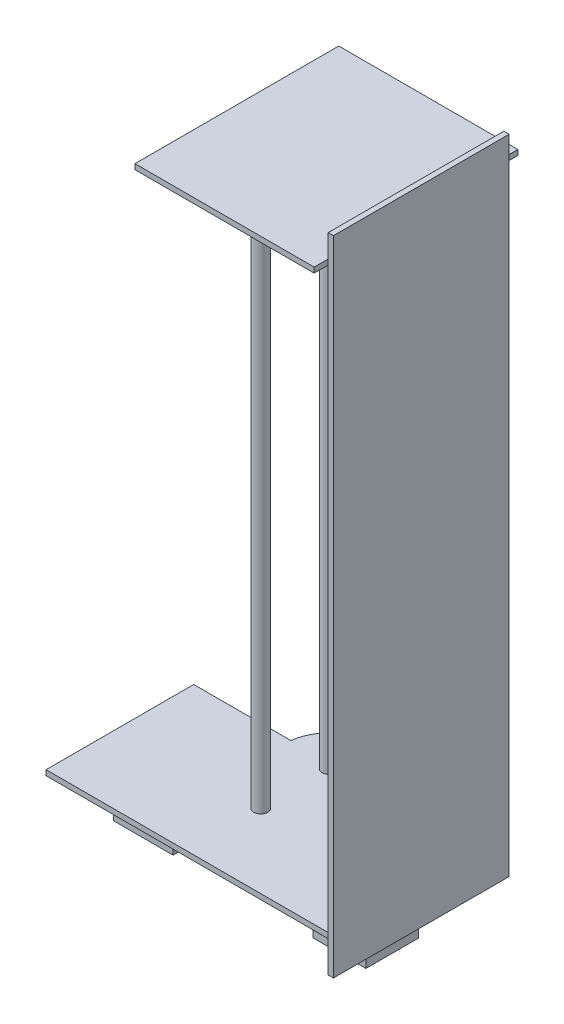
ISO-10303-21;
HEADER;
FILE_DESCRIPTION(('STEP AP214'),'2;1');
FILE_NAME('part.step','',(''),(''),'','','');
FILE_SCHEMA(('AUTOMOTIVE_DESIGN { 1 0 10303 214 1 1 1 1 }'));
ENDSEC;
DATA;
#1=APPLICATION_CONTEXT('core data for automotive mechanical design processes');
#2=APPLICATION_PROTOCOL_DEFINITION('international standard','automotive_design',2000,#1);
#3=PRODUCT_CONTEXT('',#1,'mechanical');
#4=PRODUCT('Part','Part','',(#3));
#5=PRODUCT_RELATED_PRODUCT_CATEGORY('part','',(#4));
#6=PRODUCT_DEFINITION_FORMATION('','',#4);
#7=PRODUCT_DEFINITION_CONTEXT('part definition',#1,'design');
#8=PRODUCT_DEFINITION('design','',#6,#7);
#9=PRODUCT_DEFINITION_SHAPE('','',#8);
#10=(LENGTH_UNIT() NAMED_UNIT(*) SI_UNIT(.MILLI.,.METRE.));
#11=(NAMED_UNIT(*) PLANE_ANGLE_UNIT() SI_UNIT($,.RADIAN.));
#12=(NAMED_UNIT(*) SI_UNIT($,.STERADIAN.) SOLID_ANGLE_UNIT());
#13=UNCERTAINTY_MEASURE_WITH_UNIT(LENGTH_MEASURE(1.E-05),#10,'distance_accuracy_value','');
#14=(GEOMETRIC_REPRESENTATION_CONTEXT(3) GLOBAL_UNCERTAINTY_ASSIGNED_CONTEXT((#13)) GLOBAL_UNIT_ASSIGNED_CONTEXT((#10,
#11,#12)) REPRESENTATION_CONTEXT('',''));
#15=CARTESIAN_POINT('',(0.,0.,0.));
#16=DIRECTION('',(0.,0.,1.));
#17=DIRECTION('',(1.,0.,0.));
#18=AXIS2_PLACEMENT_3D('',#15,#16,#17);
#19=CARTESIAN_POINT('',(168.5,0.,0.));
#20=DIRECTION('',(-1.,0.,0.));
#21=DIRECTION('',(0.,0.,1.));
#22=AXIS2_PLACEMENT_3D('',#19,#20,#21);
#23=PLANE('',#22);
#24=DIRECTION('',(0.,-1.,0.));
#25=VECTOR('',#24,1.);
#26=CARTESIAN_POINT('',(168.5,3.,0.));
#27=LINE('',#26,#25);
#28=CARTESIAN_POINT('',(168.5,3.,0.));
#29=VERTEX_POINT('',#28);
#30=CARTESIAN_POINT('',(168.5,0.,0.));
#31=VERTEX_POINT('',#30);
#32=EDGE_CURVE('E392',#29,#31,#27,.T.);
#33=ORIENTED_EDGE('',*,*,#32,.T.);
#34=DIRECTION('',(0.,0.,-1.));
#35=VECTOR('',#34,1.);
#36=CARTESIAN_POINT('',(168.5,0.,0.));
#37=LINE('',#36,#35);
#38=CARTESIAN_POINT('',(168.5,0.,-84.1790679657501));
#39=VERTEX_POINT('',#38);
#40=EDGE_CURVE('E361',#31,#39,#37,.T.);
#41=ORIENTED_EDGE('',*,*,#40,.T.);
#42=DIRECTION('',(0.,-1.,0.));
#43=VECTOR('',#42,1.);
#44=CARTESIAN_POINT('',(168.5,3.,-84.1790679657501));
#45=LINE('',#44,#43);
#46=CARTESIAN_POINT('',(168.5,3.,-84.1790679657501));
#47=VERTEX_POINT('',#46);
#48=EDGE_CURVE('E377',#47,#39,#45,.T.);
#49=ORIENTED_EDGE('',*,*,#48,.F.);
#50=DIRECTION('',(0.,0.,-1.));
#51=VECTOR('',#50,1.);
#52=CARTESIAN_POINT('',(168.5,3.,0.));
#53=LINE('',#52,#51);
#54=EDGE_CURVE('E375',#29,#47,#53,.T.);
#55=ORIENTED_EDGE('',*,*,#54,.F.);
#56=EDGE_LOOP('',(#33,#41,#49,#55));
#57=FACE_BOUND('',#56,.T.);
#58=DIRECTION('',(0.,-1.,0.));
#59=VECTOR('',#58,1.);
#60=CARTESIAN_POINT('',(168.5,-10.,7.91046601712495));
#61=LINE('',#60,#59);
#62=CARTESIAN_POINT('',(168.5,340.,7.91046601712495));
#63=VERTEX_POINT('',#62);
#64=CARTESIAN_POINT('',(168.5,-10.,7.91046601712495));
#65=VERTEX_POINT('',#64);
#66=EDGE_CURVE('E239',#63,#65,#61,.T.);
#67=ORIENTED_EDGE('',*,*,#66,.F.);
#68=DIRECTION('',(0.,0.,-1.));
#69=VECTOR('',#68,1.);
#70=CARTESIAN_POINT('',(168.5,340.,0.));
#71=LINE('',#70,#69);
#72=CARTESIAN_POINT('',(168.5,340.,-92.0895339828751));
#73=VERTEX_POINT('',#72);
#74=EDGE_CURVE('E46',#63,#73,#71,.T.);
#75=ORIENTED_EDGE('',*,*,#74,.T.);
#76=DIRECTION('',(0.,1.,0.));
#77=VECTOR('',#76,1.);
#78=CARTESIAN_POINT('',(168.5,-10.,-92.0895339828751));
#79=LINE('',#78,#77);
#80=CARTESIAN_POINT('',(168.5,-10.,-92.0895339828751));
#81=VERTEX_POINT('',#80);
#82=EDGE_CURVE('E262',#81,#73,#79,.T.);
#83=ORIENTED_EDGE('',*,*,#82,.F.);
#84=DIRECTION('',(0.,0.,-1.));
#85=VECTOR('',#84,1.);
#86=CARTESIAN_POINT('',(168.5,-10.,7.91046601712495));
#87=LINE('',#86,#85);
#88=EDGE_CURVE('E258',#65,#81,#87,.T.);
#89=ORIENTED_EDGE('',*,*,#88,.F.);
#90=EDGE_LOOP('',(#67,#75,#83,#89));
#91=FACE_BOUND('',#90,.T.);
#92=ADVANCED_FACE('F38',(#57,#91),#23,.T.);
#93=CARTESIAN_POINT('',(0.,0.,0.));
#94=DIRECTION('',(0.,1.,0.));
#95=DIRECTION('',(0.,0.,1.));
#96=AXIS2_PLACEMENT_3D('',#93,#94,#95);
#97=PLANE('',#96);
#98=DIRECTION('',(-1.,0.,0.));
#99=VECTOR('',#98,1.);
#100=CARTESIAN_POINT('',(11.2755253757975,0.,-57.));
#101=LINE('',#100,#99);
#102=CARTESIAN_POINT('',(45.2755253757975,0.,-57.));
#103=VERTEX_POINT('',#102);
#104=CARTESIAN_POINT('',(11.2755253757975,0.,-57.));
#105=VERTEX_POINT('',#104);
#106=EDGE_CURVE('E328',#103,#105,#101,.T.);
#107=ORIENTED_EDGE('',*,*,#106,.T.);
#108=DIRECTION('',(0.,0.,1.));
#109=VECTOR('',#108,1.);
#110=CARTESIAN_POINT('',(11.2755253757975,0.,-57.));
#111=LINE('',#110,#109);
#112=CARTESIAN_POINT('',(11.2755253757975,0.,-27.));
#113=VERTEX_POINT('',#112);
#114=EDGE_CURVE('E341',#105,#113,#111,.T.);
#115=ORIENTED_EDGE('',*,*,#114,.T.);
#116=DIRECTION('',(-1.,0.,0.));
#117=VECTOR('',#116,1.);
#118=CARTESIAN_POINT('',(11.2755253757975,0.,-27.));
#119=LINE('',#118,#117);
#120=CARTESIAN_POINT('',(45.2755253757975,0.,-27.));
#121=VERTEX_POINT('',#120);
#122=EDGE_CURVE('E323',#121,#113,#119,.T.);
#123=ORIENTED_EDGE('',*,*,#122,.F.);
#124=DIRECTION('',(0.,0.,1.));
#125=VECTOR('',#124,1.);
#126=CARTESIAN_POINT('',(45.2755253757975,0.,-57.));
#127=LINE('',#126,#125);
#128=EDGE_CURVE('E345',#103,#121,#127,.T.);
#129=ORIENTED_EDGE('',*,*,#128,.F.);
#130=EDGE_LOOP('',(#107,#115,#123,#129));
#131=FACE_BOUND('',#130,.T.);
#132=DIRECTION('',(0.999999435315813,0.,-0.00106271729752677));
#133=VECTOR('',#132,1.);
#134=CARTESIAN_POINT('',(-0.0892682025838781,0.,-83.9999051330834));
#135=LINE('',#134,#133);
#136=CARTESIAN_POINT('',(104.941145124996,0.,-84.1115228331218));
#137=VERTEX_POINT('',#136);
#138=EDGE_CURVE('E356',#137,#39,#135,.T.);
#139=ORIENTED_EDGE('',*,*,#138,.T.);
#140=ORIENTED_EDGE('',*,*,#40,.F.);
#141=DIRECTION('',(1.,0.,0.));
#142=VECTOR('',#141,1.);
#143=CARTESIAN_POINT('',(0.,0.,0.));
#144=LINE('',#143,#142);
#145=CARTESIAN_POINT('',(0.,0.,0.));
#146=VERTEX_POINT('',#145);
#147=EDGE_CURVE('E387',#146,#31,#144,.T.);
#148=ORIENTED_EDGE('',*,*,#147,.F.);
#149=DIRECTION('',(0.,0.,-1.));
#150=VECTOR('',#149,1.);
#151=CARTESIAN_POINT('',(0.,0.,0.));
#152=LINE('',#151,#150);
#153=CARTESIAN_POINT('',(0.,0.,-84.));
#154=VERTEX_POINT('',#153);
#155=EDGE_CURVE('E384',#146,#154,#152,.T.);
#156=ORIENTED_EDGE('',*,*,#155,.T.);
#157=CARTESIAN_POINT('',(55.3024785712186,0.,-84.0587709337608));
#158=VERTEX_POINT('',#157);
#159=EDGE_CURVE('E381',#154,#158,#135,.T.);
#160=ORIENTED_EDGE('',*,*,#159,.T.);
#161=CARTESIAN_POINT('',(80.125,0.,-81.0851485774938));
#162=DIRECTION('',(0.,1.,0.));
#163=DIRECTION('',(0.,0.,1.));
#164=AXIS2_PLACEMENT_3D('',#161,#162,#163);
#165=CIRCLE('',#164,25.);
#166=EDGE_CURVE('E380',#137,#158,#165,.T.);
#167=ORIENTED_EDGE('',*,*,#166,.F.);
#168=EDGE_LOOP('',(#139,#140,#148,#156,#160,#167));
#169=FACE_BOUND('',#168,.T.);
#170=DIRECTION('',(-1.,0.,0.));
#171=VECTOR('',#170,1.);
#172=CARTESIAN_POINT('',(125.075525375797,0.,-57.));
#173=LINE('',#172,#171);
#174=CARTESIAN_POINT('',(155.075525375797,0.,-57.));
#175=VERTEX_POINT('',#174);
#176=CARTESIAN_POINT('',(125.075525375797,0.,-57.));
#177=VERTEX_POINT('',#176);
#178=EDGE_CURVE('E294',#175,#177,#173,.T.);
#179=ORIENTED_EDGE('',*,*,#178,.T.);
#180=DIRECTION('',(0.,0.,1.));
#181=VECTOR('',#180,1.);
#182=CARTESIAN_POINT('',(125.075525375797,0.,-57.));
#183=LINE('',#182,#181);
#184=CARTESIAN_POINT('',(125.075525375797,0.,-27.));
#185=VERTEX_POINT('',#184);
#186=EDGE_CURVE('E304',#177,#185,#183,.T.);
#187=ORIENTED_EDGE('',*,*,#186,.T.);
#188=DIRECTION('',(-1.,0.,0.));
#189=VECTOR('',#188,1.);
#190=CARTESIAN_POINT('',(125.075525375797,0.,-27.));
#191=LINE('',#190,#189);
#192=CARTESIAN_POINT('',(155.075525375797,0.,-27.));
#193=VERTEX_POINT('',#192);
#194=EDGE_CURVE('E289',#193,#185,#191,.T.);
#195=ORIENTED_EDGE('',*,*,#194,.F.);
#196=DIRECTION('',(0.,0.,1.));
#197=VECTOR('',#196,1.);
#198=CARTESIAN_POINT('',(155.075525375797,0.,-57.));
#199=LINE('',#198,#197);
#200=EDGE_CURVE('E308',#175,#193,#199,.T.);
#201=ORIENTED_EDGE('',*,*,#200,.F.);
#202=EDGE_LOOP('',(#179,#187,#195,#201));
#203=FACE_BOUND('',#202,.T.);
#204=ADVANCED_FACE('F446',(#131,#169,#203),#97,.F.);
#205=CARTESIAN_POINT('',(-0.0892682025838781,3.,-83.9999051330834));
#206=DIRECTION('',(-0.00106271729752677,0.,-0.999999435315813));
#207=DIRECTION('',(-0.999999435315813,0.,0.00106271729752677));
#208=AXIS2_PLACEMENT_3D('',#205,#206,#207);
#209=PLANE('',#208);
#210=ORIENTED_EDGE('',*,*,#138,.F.);
#211=DIRECTION('',(0.,-1.,0.));
#212=VECTOR('',#211,1.);
#213=CARTESIAN_POINT('',(104.941145124996,3.,-84.1115228331218));
#214=LINE('',#213,#212);
#215=CARTESIAN_POINT('',(104.941145124996,3.,-84.1115228331218));
#216=VERTEX_POINT('',#215);
#217=EDGE_CURVE('E401',#216,#137,#214,.T.);
#218=ORIENTED_EDGE('',*,*,#217,.F.);
#219=DIRECTION('',(0.999999435315813,0.,-0.00106271729752677));
#220=VECTOR('',#219,1.);
#221=CARTESIAN_POINT('',(-0.0892682025838781,3.,-83.9999051330834));
#222=LINE('',#221,#220);
#223=EDGE_CURVE('E364',#216,#47,#222,.T.);
#224=ORIENTED_EDGE('',*,*,#223,.T.);
#225=ORIENTED_EDGE('',*,*,#48,.T.);
#226=EDGE_LOOP('',(#210,#218,#224,#225));
#227=FACE_BOUND('',#226,.T.);
#228=ADVANCED_FACE('F451',(#227),#209,.T.);
#229=CARTESIAN_POINT('',(80.125,3.,-81.0851485774938));
#230=DIRECTION('',(0.,-1.,0.));
#231=DIRECTION('',(0.,0.,-1.));
#232=AXIS2_PLACEMENT_3D('',#229,#230,#231);
#233=CYLINDRICAL_SURFACE('',#232,25.);
#234=ORIENTED_EDGE('',*,*,#166,.T.);
#235=DIRECTION('',(0.,-1.,0.));
#236=VECTOR('',#235,1.);
#237=CARTESIAN_POINT('',(55.3024785712186,3.,-84.0587709337608));
#238=LINE('',#237,#236);
#239=CARTESIAN_POINT('',(55.3024785712186,3.,-84.0587709337608));
#240=VERTEX_POINT('',#239);
#241=EDGE_CURVE('E399',#240,#158,#238,.T.);
#242=ORIENTED_EDGE('',*,*,#241,.F.);
#243=CARTESIAN_POINT('',(80.125,3.,-81.0851485774938));
#244=DIRECTION('',(0.,1.,0.));
#245=DIRECTION('',(0.,0.,1.));
#246=AXIS2_PLACEMENT_3D('',#243,#244,#245);
#247=CIRCLE('',#246,25.);
#248=EDGE_CURVE('E367',#216,#240,#247,.T.);
#249=ORIENTED_EDGE('',*,*,#248,.F.);
#250=ORIENTED_EDGE('',*,*,#217,.T.);
#251=EDGE_LOOP('',(#234,#242,#249,#250));
#252=FACE_BOUND('',#251,.T.);
#253=ADVANCED_FACE('F40',(#252),#233,.T.);
#254=ORIENTED_EDGE('',*,*,#159,.F.);
#255=DIRECTION('',(0.,-1.,0.));
#256=VECTOR('',#255,1.);
#257=CARTESIAN_POINT('',(0.,3.,-84.));
#258=LINE('',#257,#256);
#259=CARTESIAN_POINT('',(0.,3.,-84.));
#260=VERTEX_POINT('',#259);
#261=EDGE_CURVE('E397',#260,#154,#258,.T.);
#262=ORIENTED_EDGE('',*,*,#261,.F.);
#263=EDGE_CURVE('E368',#260,#240,#222,.T.);
#264=ORIENTED_EDGE('',*,*,#263,.T.);
#265=ORIENTED_EDGE('',*,*,#241,.T.);
#266=EDGE_LOOP('',(#254,#262,#264,#265));
#267=FACE_BOUND('',#266,.T.);
#268=ADVANCED_FACE('F527',(#267),#209,.T.);
#269=CARTESIAN_POINT('',(0.,3.,0.));
#270=DIRECTION('',(-1.,0.,0.));
#271=DIRECTION('',(0.,0.,1.));
#272=AXIS2_PLACEMENT_3D('',#269,#270,#271);
#273=PLANE('',#272);
#274=ORIENTED_EDGE('',*,*,#155,.F.);
#275=DIRECTION('',(0.,-1.,0.));
#276=VECTOR('',#275,1.);
#277=CARTESIAN_POINT('',(0.,3.,0.));
#278=LINE('',#277,#276);
#279=CARTESIAN_POINT('',(0.,3.,0.));
#280=VERTEX_POINT('',#279);
#281=EDGE_CURVE('E395',#280,#146,#278,.T.);
#282=ORIENTED_EDGE('',*,*,#281,.F.);
#283=DIRECTION('',(0.,0.,-1.));
#284=VECTOR('',#283,1.);
#285=CARTESIAN_POINT('',(0.,3.,0.));
#286=LINE('',#285,#284);
#287=EDGE_CURVE('E370',#280,#260,#286,.T.);
#288=ORIENTED_EDGE('',*,*,#287,.T.);
#289=ORIENTED_EDGE('',*,*,#261,.T.);
#290=EDGE_LOOP('',(#274,#282,#288,#289));
#291=FACE_BOUND('',#290,.T.);
#292=ADVANCED_FACE('F524',(#291),#273,.T.);
#293=CARTESIAN_POINT('',(0.,3.,0.));
#294=DIRECTION('',(0.,0.,-1.));
#295=DIRECTION('',(-1.,0.,0.));
#296=AXIS2_PLACEMENT_3D('',#293,#294,#295);
#297=PLANE('',#296);
#298=ORIENTED_EDGE('',*,*,#147,.T.);
#299=ORIENTED_EDGE('',*,*,#32,.F.);
#300=DIRECTION('',(1.,0.,0.));
#301=VECTOR('',#300,1.);
#302=CARTESIAN_POINT('',(0.,3.,0.));
#303=LINE('',#302,#301);
#304=EDGE_CURVE('E373',#280,#29,#303,.T.);
#305=ORIENTED_EDGE('',*,*,#304,.F.);
#306=ORIENTED_EDGE('',*,*,#281,.T.);
#307=EDGE_LOOP('',(#298,#299,#305,#306));
#308=FACE_BOUND('',#307,.T.);
#309=ADVANCED_FACE('F519',(#308),#297,.F.);
#310=CARTESIAN_POINT('',(0.,3.,0.));
#311=DIRECTION('',(0.,1.,0.));
#312=DIRECTION('',(0.,0.,1.));
#313=AXIS2_PLACEMENT_3D('',#310,#311,#312);
#314=PLANE('',#313);
#315=CARTESIAN_POINT('',(80.125,3.,-81.0851485774938));
#316=DIRECTION('',(0.,1.,0.));
#317=DIRECTION('',(0.,0.,1.));
#318=AXIS2_PLACEMENT_3D('',#315,#316,#317);
#319=CIRCLE('',#318,4.00000000000001);
#320=CARTESIAN_POINT('',(80.125,3.,-77.0851485774938));
#321=VERTEX_POINT('',#320);
#322=EDGE_CURVE('E357',#321,#321,#319,.T.);
#323=ORIENTED_EDGE('',*,*,#322,.F.);
#324=EDGE_LOOP('',(#323));
#325=FACE_BOUND('',#324,.T.);
#326=CARTESIAN_POINT('',(80.125,3.,-42.0851485774938));
#327=DIRECTION('',(0.,1.,0.));
#328=DIRECTION('',(0.,0.,1.));
#329=AXIS2_PLACEMENT_3D('',#326,#327,#328);
#330=CIRCLE('',#329,4.00000000000001);
#331=CARTESIAN_POINT('',(80.125,3.,-38.0851485774938));
#332=VERTEX_POINT('',#331);
#333=EDGE_CURVE('E360',#332,#332,#330,.T.);
#334=ORIENTED_EDGE('',*,*,#333,.F.);
#335=EDGE_LOOP('',(#334));
#336=FACE_BOUND('',#335,.T.);
#337=ORIENTED_EDGE('',*,*,#223,.F.);
#338=ORIENTED_EDGE('',*,*,#248,.T.);
#339=ORIENTED_EDGE('',*,*,#263,.F.);
#340=ORIENTED_EDGE('',*,*,#287,.F.);
#341=ORIENTED_EDGE('',*,*,#304,.T.);
#342=ORIENTED_EDGE('',*,*,#54,.T.);
#343=EDGE_LOOP('',(#337,#338,#339,#340,#341,#342));
#344=FACE_BOUND('',#343,.T.);
#345=ADVANCED_FACE('F516',(#325,#336,#344),#314,.T.);
#346=CARTESIAN_POINT('',(80.125,340.,-81.0851485774938));
#347=DIRECTION('',(0.,-1.,0.));
#348=DIRECTION('',(0.,0.,-1.));
#349=AXIS2_PLACEMENT_3D('',#346,#347,#348);
#350=CYLINDRICAL_SURFACE('',#349,4.00000000000001);
#351=ORIENTED_EDGE('',*,*,#322,.T.);
#352=EDGE_LOOP('',(#351));
#353=FACE_BOUND('',#352,.T.);
#354=CARTESIAN_POINT('',(80.125,340.,-81.0851485774938));
#355=DIRECTION('',(0.,1.,0.));
#356=DIRECTION('',(0.,0.,1.));
#357=AXIS2_PLACEMENT_3D('',#354,#355,#356);
#358=CIRCLE('',#357,4.00000000000001);
#359=CARTESIAN_POINT('',(80.125,340.,-77.0851485774938));
#360=VERTEX_POINT('',#359);
#361=EDGE_CURVE('E353',#360,#360,#358,.T.);
#362=ORIENTED_EDGE('',*,*,#361,.F.);
#363=EDGE_LOOP('',(#362));
#364=FACE_BOUND('',#363,.T.);
#365=ADVANCED_FACE('F512',(#353,#364),#350,.T.);
#366=CARTESIAN_POINT('',(80.125,340.,-42.0851485774938));
#367=DIRECTION('',(0.,-1.,0.));
#368=DIRECTION('',(0.,0.,-1.));
#369=AXIS2_PLACEMENT_3D('',#366,#367,#368);
#370=CYLINDRICAL_SURFACE('',#369,4.00000000000001);
#371=ORIENTED_EDGE('',*,*,#333,.T.);
#372=EDGE_LOOP('',(#371));
#373=FACE_BOUND('',#372,.T.);
#374=CARTESIAN_POINT('',(80.125,340.,-42.0851485774938));
#375=DIRECTION('',(0.,1.,0.));
#376=DIRECTION('',(0.,0.,1.));
#377=AXIS2_PLACEMENT_3D('',#374,#375,#376);
#378=CIRCLE('',#377,4.00000000000001);
#379=CARTESIAN_POINT('',(80.125,340.,-38.0851485774938));
#380=VERTEX_POINT('',#379);
#381=EDGE_CURVE('E344',#380,#380,#378,.T.);
#382=ORIENTED_EDGE('',*,*,#381,.F.);
#383=EDGE_LOOP('',(#382));
#384=FACE_BOUND('',#383,.T.);
#385=ADVANCED_FACE('F508',(#373,#384),#370,.T.);
#386=CARTESIAN_POINT('',(11.2755253757975,0.,-57.));
#387=DIRECTION('',(-1.,0.,0.));
#388=DIRECTION('',(0.,-1.,0.));
#389=AXIS2_PLACEMENT_3D('',#386,#387,#388);
#390=PLANE('',#389);
#391=DIRECTION('',(0.,-1.,0.));
#392=VECTOR('',#391,1.);
#393=CARTESIAN_POINT('',(11.2755253757975,0.,-27.));
#394=LINE('',#393,#392);
#395=CARTESIAN_POINT('',(11.2755253757975,-30.,-27.));
#396=VERTEX_POINT('',#395);
#397=EDGE_CURVE('E316',#113,#396,#394,.T.);
#398=ORIENTED_EDGE('',*,*,#397,.F.);
#399=ORIENTED_EDGE('',*,*,#114,.F.);
#400=DIRECTION('',(0.,-1.,0.));
#401=VECTOR('',#400,1.);
#402=CARTESIAN_POINT('',(11.2755253757975,0.,-57.));
#403=LINE('',#402,#401);
#404=CARTESIAN_POINT('',(11.2755253757975,-30.,-57.));
#405=VERTEX_POINT('',#404);
#406=EDGE_CURVE('E319',#105,#405,#403,.T.);
#407=ORIENTED_EDGE('',*,*,#406,.T.);
#408=DIRECTION('',(0.,0.,1.));
#409=VECTOR('',#408,1.);
#410=CARTESIAN_POINT('',(11.2755253757975,-30.,-57.));
#411=LINE('',#410,#409);
#412=EDGE_CURVE('E331',#405,#396,#411,.T.);
#413=ORIENTED_EDGE('',*,*,#412,.T.);
#414=EDGE_LOOP('',(#398,#399,#407,#413));
#415=FACE_BOUND('',#414,.T.);
#416=ADVANCED_FACE('F501',(#415),#390,.T.);
#417=CARTESIAN_POINT('',(45.2755253757975,0.,-57.));
#418=DIRECTION('',(1.,0.,0.));
#419=DIRECTION('',(0.,1.,0.));
#420=AXIS2_PLACEMENT_3D('',#417,#418,#419);
#421=PLANE('',#420);
#422=DIRECTION('',(0.,1.,0.));
#423=VECTOR('',#422,1.);
#424=CARTESIAN_POINT('',(45.2755253757975,0.,-27.));
#425=LINE('',#424,#423);
#426=CARTESIAN_POINT('',(45.2755253757975,-30.,-27.));
#427=VERTEX_POINT('',#426);
#428=EDGE_CURVE('E337',#427,#121,#425,.T.);
#429=ORIENTED_EDGE('',*,*,#428,.F.);
#430=DIRECTION('',(0.,0.,1.));
#431=VECTOR('',#430,1.);
#432=CARTESIAN_POINT('',(45.2755253757975,-30.,-57.));
#433=LINE('',#432,#431);
#434=CARTESIAN_POINT('',(45.2755253757975,-30.,-57.));
#435=VERTEX_POINT('',#434);
#436=EDGE_CURVE('E348',#435,#427,#433,.T.);
#437=ORIENTED_EDGE('',*,*,#436,.F.);
#438=DIRECTION('',(0.,1.,0.));
#439=VECTOR('',#438,1.);
#440=CARTESIAN_POINT('',(45.2755253757975,0.,-57.));
#441=LINE('',#440,#439);
#442=EDGE_CURVE('E326',#435,#103,#441,.T.);
#443=ORIENTED_EDGE('',*,*,#442,.T.);
#444=ORIENTED_EDGE('',*,*,#128,.T.);
#445=EDGE_LOOP('',(#429,#437,#443,#444));
#446=FACE_BOUND('',#445,.T.);
#447=ADVANCED_FACE('F498',(#446),#421,.T.);
#448=CARTESIAN_POINT('',(11.2755253757975,-30.,-57.));
#449=DIRECTION('',(0.,-1.,0.));
#450=DIRECTION('',(0.,0.,-1.));
#451=AXIS2_PLACEMENT_3D('',#448,#449,#450);
#452=PLANE('',#451);
#453=DIRECTION('',(1.,0.,0.));
#454=VECTOR('',#453,1.);
#455=CARTESIAN_POINT('',(11.2755253757975,-30.,-27.));
#456=LINE('',#455,#454);
#457=EDGE_CURVE('E334',#396,#427,#456,.T.);
#458=ORIENTED_EDGE('',*,*,#457,.F.);
#459=ORIENTED_EDGE('',*,*,#412,.F.);
#460=DIRECTION('',(1.,0.,0.));
#461=VECTOR('',#460,1.);
#462=CARTESIAN_POINT('',(11.2755253757975,-30.,-57.));
#463=LINE('',#462,#461);
#464=EDGE_CURVE('E322',#405,#435,#463,.T.);
#465=ORIENTED_EDGE('',*,*,#464,.T.);
#466=ORIENTED_EDGE('',*,*,#436,.T.);
#467=EDGE_LOOP('',(#458,#459,#465,#466));
#468=FACE_BOUND('',#467,.T.);
#469=ADVANCED_FACE('F493',(#468),#452,.T.);
#470=CARTESIAN_POINT('',(0.,0.,-57.));
#471=DIRECTION('',(0.,0.,1.));
#472=DIRECTION('',(1.,0.,0.));
#473=AXIS2_PLACEMENT_3D('',#470,#471,#472);
#474=PLANE('',#473);
#475=CARTESIAN_POINT('',(28.2755253757975,-15.,-57.));
#476=DIRECTION('',(0.,0.,1.));
#477=DIRECTION('',(1.,0.,0.));
#478=AXIS2_PLACEMENT_3D('',#475,#476,#477);
#479=CIRCLE('',#478,4.00000000000001);
#480=CARTESIAN_POINT('',(32.2755253757975,-15.,-57.));
#481=VERTEX_POINT('',#480);
#482=EDGE_CURVE('E313',#481,#481,#479,.T.);
#483=ORIENTED_EDGE('',*,*,#482,.T.);
#484=EDGE_LOOP('',(#483));
#485=FACE_BOUND('',#484,.T.);
#486=ORIENTED_EDGE('',*,*,#406,.F.);
#487=ORIENTED_EDGE('',*,*,#106,.F.);
#488=ORIENTED_EDGE('',*,*,#442,.F.);
#489=ORIENTED_EDGE('',*,*,#464,.F.);
#490=EDGE_LOOP('',(#486,#487,#488,#489));
#491=FACE_BOUND('',#490,.T.);
#492=ADVANCED_FACE('F490',(#485,#491),#474,.F.);
#493=CARTESIAN_POINT('',(0.,0.,-27.));
#494=DIRECTION('',(0.,0.,1.));
#495=DIRECTION('',(1.,0.,0.));
#496=AXIS2_PLACEMENT_3D('',#493,#494,#495);
#497=PLANE('',#496);
#498=CARTESIAN_POINT('',(28.2755253757975,-15.,-27.));
#499=DIRECTION('',(0.,0.,1.));
#500=DIRECTION('',(1.,0.,0.));
#501=AXIS2_PLACEMENT_3D('',#498,#499,#500);
#502=CIRCLE('',#501,4.00000000000001);
#503=CARTESIAN_POINT('',(32.2755253757975,-15.,-27.));
#504=VERTEX_POINT('',#503);
#505=EDGE_CURVE('E307',#504,#504,#502,.T.);
#506=ORIENTED_EDGE('',*,*,#505,.F.);
#507=EDGE_LOOP('',(#506));
#508=FACE_BOUND('',#507,.T.);
#509=ORIENTED_EDGE('',*,*,#397,.T.);
#510=ORIENTED_EDGE('',*,*,#457,.T.);
#511=ORIENTED_EDGE('',*,*,#428,.T.);
#512=ORIENTED_EDGE('',*,*,#122,.T.);
#513=EDGE_LOOP('',(#509,#510,#511,#512));
#514=FACE_BOUND('',#513,.T.);
#515=ADVANCED_FACE('F488',(#508,#514),#497,.T.);
#516=CARTESIAN_POINT('',(28.2755253757975,-15.,-57.));
#517=DIRECTION('',(0.,0.,1.));
#518=DIRECTION('',(1.,0.,0.));
#519=AXIS2_PLACEMENT_3D('',#516,#517,#518);
#520=CYLINDRICAL_SURFACE('',#519,4.00000000000001);
#521=ORIENTED_EDGE('',*,*,#482,.F.);
#522=EDGE_LOOP('',(#521));
#523=FACE_BOUND('',#522,.T.);
#524=ORIENTED_EDGE('',*,*,#505,.T.);
#525=EDGE_LOOP('',(#524));
#526=FACE_BOUND('',#525,.T.);
#527=ADVANCED_FACE('F484',(#523,#526),#520,.F.);
#528=CARTESIAN_POINT('',(125.075525375797,0.,-57.));
#529=DIRECTION('',(-1.,0.,0.));
#530=DIRECTION('',(0.,0.,1.));
#531=AXIS2_PLACEMENT_3D('',#528,#529,#530);
#532=PLANE('',#531);
#533=DIRECTION('',(0.,-1.,0.));
#534=VECTOR('',#533,1.);
#535=CARTESIAN_POINT('',(125.075525375797,0.,-27.));
#536=LINE('',#535,#534);
#537=CARTESIAN_POINT('',(125.075525375797,-30.9791715867077,-27.));
#538=VERTEX_POINT('',#537);
#539=EDGE_CURVE('E282',#185,#538,#536,.T.);
#540=ORIENTED_EDGE('',*,*,#539,.F.);
#541=ORIENTED_EDGE('',*,*,#186,.F.);
#542=DIRECTION('',(0.,-1.,0.));
#543=VECTOR('',#542,1.);
#544=CARTESIAN_POINT('',(125.075525375797,0.,-57.));
#545=LINE('',#544,#543);
#546=CARTESIAN_POINT('',(125.075525375797,-30.9791715867077,-57.));
#547=VERTEX_POINT('',#546);
#548=EDGE_CURVE('E285',#177,#547,#545,.T.);
#549=ORIENTED_EDGE('',*,*,#548,.T.);
#550=DIRECTION('',(0.,0.,1.));
#551=VECTOR('',#550,1.);
#552=CARTESIAN_POINT('',(125.075525375797,-30.9791715867077,-57.));
#553=LINE('',#552,#551);
#554=EDGE_CURVE('E297',#547,#538,#553,.T.);
#555=ORIENTED_EDGE('',*,*,#554,.T.);
#556=EDGE_LOOP('',(#540,#541,#549,#555));
#557=FACE_BOUND('',#556,.T.);
#558=ADVANCED_FACE('F477',(#557),#532,.T.);
#559=CARTESIAN_POINT('',(155.075525375797,0.,-57.));
#560=DIRECTION('',(1.,0.,0.));
#561=DIRECTION('',(0.,0.,-1.));
#562=AXIS2_PLACEMENT_3D('',#559,#560,#561);
#563=PLANE('',#562);
#564=DIRECTION('',(0.,1.,0.));
#565=VECTOR('',#564,1.);
#566=CARTESIAN_POINT('',(155.075525375797,0.,-27.));
#567=LINE('',#566,#565);
#568=CARTESIAN_POINT('',(155.075525375797,-30.9791715867077,-27.));
#569=VERTEX_POINT('',#568);
#570=EDGE_CURVE('E61',#569,#193,#567,.T.);
#571=ORIENTED_EDGE('',*,*,#570,.F.);
#572=DIRECTION('',(0.,0.,1.));
#573=VECTOR('',#572,1.);
#574=CARTESIAN_POINT('',(155.075525375797,-30.9791715867077,-57.));
#575=LINE('',#574,#573);
#576=CARTESIAN_POINT('',(155.075525375797,-30.9791715867077,-57.));
#577=VERTEX_POINT('',#576);
#578=EDGE_CURVE('E310',#577,#569,#575,.T.);
#579=ORIENTED_EDGE('',*,*,#578,.F.);
#580=DIRECTION('',(0.,1.,0.));
#581=VECTOR('',#580,1.);
#582=CARTESIAN_POINT('',(155.075525375797,0.,-57.));
#583=LINE('',#582,#581);
#584=EDGE_CURVE('E292',#577,#175,#583,.T.);
#585=ORIENTED_EDGE('',*,*,#584,.T.);
#586=ORIENTED_EDGE('',*,*,#200,.T.);
#587=EDGE_LOOP('',(#571,#579,#585,#586));
#588=FACE_BOUND('',#587,.T.);
#589=ADVANCED_FACE('F474',(#588),#563,.T.);
#590=CARTESIAN_POINT('',(125.075525375797,-30.9791715867077,-57.));
#591=DIRECTION('',(0.,-1.,0.));
#592=DIRECTION('',(0.,0.,-1.));
#593=AXIS2_PLACEMENT_3D('',#590,#591,#592);
#594=PLANE('',#593);
#595=DIRECTION('',(1.,0.,0.));
#596=VECTOR('',#595,1.);
#597=CARTESIAN_POINT('',(125.075525375797,-30.9791715867077,-27.));
#598=LINE('',#597,#596);
#599=EDGE_CURVE('E300',#538,#569,#598,.T.);
#600=ORIENTED_EDGE('',*,*,#599,.F.);
#601=ORIENTED_EDGE('',*,*,#554,.F.);
#602=DIRECTION('',(1.,0.,0.));
#603=VECTOR('',#602,1.);
#604=CARTESIAN_POINT('',(125.075525375797,-30.9791715867077,-57.));
#605=LINE('',#604,#603);
#606=EDGE_CURVE('E288',#547,#577,#605,.T.);
#607=ORIENTED_EDGE('',*,*,#606,.T.);
#608=ORIENTED_EDGE('',*,*,#578,.T.);
#609=EDGE_LOOP('',(#600,#601,#607,#608));
#610=FACE_BOUND('',#609,.T.);
#611=ADVANCED_FACE('F469',(#610),#594,.T.);
#612=CARTESIAN_POINT('',(0.,0.,-57.));
#613=DIRECTION('',(0.,0.,1.));
#614=DIRECTION('',(1.,0.,0.));
#615=AXIS2_PLACEMENT_3D('',#612,#613,#614);
#616=PLANE('',#615);
#617=CARTESIAN_POINT('',(140.075525375797,-21.,-57.));
#618=DIRECTION('',(0.,0.,1.));
#619=DIRECTION('',(1.,0.,0.));
#620=AXIS2_PLACEMENT_3D('',#617,#618,#619);
#621=CIRCLE('',#620,3.99999999999999);
#622=CARTESIAN_POINT('',(144.075525375797,-21.,-57.));
#623=VERTEX_POINT('',#622);
#624=EDGE_CURVE('E279',#623,#623,#621,.T.);
#625=ORIENTED_EDGE('',*,*,#624,.T.);
#626=EDGE_LOOP('',(#625));
#627=FACE_BOUND('',#626,.T.);
#628=ORIENTED_EDGE('',*,*,#548,.F.);
#629=ORIENTED_EDGE('',*,*,#178,.F.);
#630=ORIENTED_EDGE('',*,*,#584,.F.);
#631=ORIENTED_EDGE('',*,*,#606,.F.);
#632=EDGE_LOOP('',(#628,#629,#630,#631));
#633=FACE_BOUND('',#632,.T.);
#634=ADVANCED_FACE('F466',(#627,#633),#616,.F.);
#635=CARTESIAN_POINT('',(0.,0.,-27.));
#636=DIRECTION('',(0.,0.,1.));
#637=DIRECTION('',(1.,0.,0.));
#638=AXIS2_PLACEMENT_3D('',#635,#636,#637);
#639=PLANE('',#638);
#640=CARTESIAN_POINT('',(140.075525375797,-21.,-27.));
#641=DIRECTION('',(0.,0.,1.));
#642=DIRECTION('',(1.,0.,0.));
#643=AXIS2_PLACEMENT_3D('',#640,#641,#642);
#644=CIRCLE('',#643,3.99999999999999);
#645=CARTESIAN_POINT('',(144.075525375797,-21.,-27.));
#646=VERTEX_POINT('',#645);
#647=EDGE_CURVE('E278',#646,#646,#644,.T.);
#648=ORIENTED_EDGE('',*,*,#647,.F.);
#649=EDGE_LOOP('',(#648));
#650=FACE_BOUND('',#649,.T.);
#651=ORIENTED_EDGE('',*,*,#539,.T.);
#652=ORIENTED_EDGE('',*,*,#599,.T.);
#653=ORIENTED_EDGE('',*,*,#570,.T.);
#654=ORIENTED_EDGE('',*,*,#194,.T.);
#655=EDGE_LOOP('',(#651,#652,#653,#654));
#656=FACE_BOUND('',#655,.T.);
#657=ADVANCED_FACE('F464',(#650,#656),#639,.T.);
#658=CARTESIAN_POINT('',(140.075525375797,-21.,-57.));
#659=DIRECTION('',(0.,0.,1.));
#660=DIRECTION('',(1.,0.,0.));
#661=AXIS2_PLACEMENT_3D('',#658,#659,#660);
#662=CYLINDRICAL_SURFACE('',#661,3.99999999999999);
#663=ORIENTED_EDGE('',*,*,#624,.F.);
#664=EDGE_LOOP('',(#663));
#665=FACE_BOUND('',#664,.T.);
#666=ORIENTED_EDGE('',*,*,#647,.T.);
#667=EDGE_LOOP('',(#666));
#668=FACE_BOUND('',#667,.T.);
#669=ADVANCED_FACE('F461',(#665,#668),#662,.F.);
#670=CARTESIAN_POINT('',(171.5,-10.,7.91046601712495));
#671=DIRECTION('',(0.,0.,-1.));
#672=DIRECTION('',(-1.,0.,0.));
#673=AXIS2_PLACEMENT_3D('',#670,#671,#672);
#674=PLANE('',#673);
#675=CARTESIAN_POINT('',(168.5,356.,7.91046601712495));
#676=VERTEX_POINT('',#675);
#677=CARTESIAN_POINT('',(168.5,343.,7.91046601712495));
#678=VERTEX_POINT('',#677);
#679=EDGE_CURVE('E255',#676,#678,#61,.T.);
#680=ORIENTED_EDGE('',*,*,#679,.T.);
#681=EDGE_CURVE('E259',#678,#63,#61,.T.);
#682=ORIENTED_EDGE('',*,*,#681,.T.);
#683=ORIENTED_EDGE('',*,*,#66,.T.);
#684=DIRECTION('',(-1.,0.,0.));
#685=VECTOR('',#684,1.);
#686=CARTESIAN_POINT('',(171.5,-10.,7.91046601712495));
#687=LINE('',#686,#685);
#688=CARTESIAN_POINT('',(171.5,-10.,7.91046601712495));
#689=VERTEX_POINT('',#688);
#690=EDGE_CURVE('E275',#689,#65,#687,.T.);
#691=ORIENTED_EDGE('',*,*,#690,.F.);
#692=DIRECTION('',(0.,-1.,0.));
#693=VECTOR('',#692,1.);
#694=CARTESIAN_POINT('',(171.5,-10.,7.91046601712495));
#695=LINE('',#694,#693);
#696=CARTESIAN_POINT('',(171.5,356.,7.91046601712495));
#697=VERTEX_POINT('',#696);
#698=EDGE_CURVE('E244',#697,#689,#695,.T.);
#699=ORIENTED_EDGE('',*,*,#698,.F.);
#700=DIRECTION('',(-1.,0.,0.));
#701=VECTOR('',#700,1.);
#702=CARTESIAN_POINT('',(171.5,356.,7.91046601712495));
#703=LINE('',#702,#701);
#704=EDGE_CURVE('E254',#697,#676,#703,.T.);
#705=ORIENTED_EDGE('',*,*,#704,.T.);
#706=EDGE_LOOP('',(#680,#682,#683,#691,#699,#705));
#707=FACE_BOUND('',#706,.T.);
#708=ADVANCED_FACE('F420',(#707),#674,.F.);
#709=CARTESIAN_POINT('',(171.5,-10.,7.91046601712495));
#710=DIRECTION('',(0.,1.,0.));
#711=DIRECTION('',(0.,0.,1.));
#712=AXIS2_PLACEMENT_3D('',#709,#710,#711);
#713=PLANE('',#712);
#714=ORIENTED_EDGE('',*,*,#88,.T.);
#715=DIRECTION('',(-1.,0.,0.));
#716=VECTOR('',#715,1.);
#717=CARTESIAN_POINT('',(171.5,-10.,-92.0895339828751));
#718=LINE('',#717,#716);
#719=CARTESIAN_POINT('',(171.5,-10.,-92.0895339828751));
#720=VERTEX_POINT('',#719);
#721=EDGE_CURVE('E272',#720,#81,#718,.T.);
#722=ORIENTED_EDGE('',*,*,#721,.F.);
#723=DIRECTION('',(0.,0.,-1.));
#724=VECTOR('',#723,1.);
#725=CARTESIAN_POINT('',(171.5,-10.,7.91046601712495));
#726=LINE('',#725,#724);
#727=EDGE_CURVE('E247',#689,#720,#726,.T.);
#728=ORIENTED_EDGE('',*,*,#727,.F.);
#729=ORIENTED_EDGE('',*,*,#690,.T.);
#730=EDGE_LOOP('',(#714,#722,#728,#729));
#731=FACE_BOUND('',#730,.T.);
#732=ADVANCED_FACE('F416',(#731),#713,.F.);
#733=CARTESIAN_POINT('',(171.5,-10.,-92.0895339828751));
#734=DIRECTION('',(0.,0.,1.));
#735=DIRECTION('',(1.,0.,0.));
#736=AXIS2_PLACEMENT_3D('',#733,#734,#735);
#737=PLANE('',#736);
#738=ORIENTED_EDGE('',*,*,#82,.T.);
#739=CARTESIAN_POINT('',(168.5,343.,-92.089533982875));
#740=VERTEX_POINT('',#739);
#741=EDGE_CURVE('E265',#73,#740,#79,.T.);
#742=ORIENTED_EDGE('',*,*,#741,.T.);
#743=CARTESIAN_POINT('',(168.5,356.,-92.0895339828751));
#744=VERTEX_POINT('',#743);
#745=EDGE_CURVE('E261',#740,#744,#79,.T.);
#746=ORIENTED_EDGE('',*,*,#745,.T.);
#747=DIRECTION('',(-1.,0.,0.));
#748=VECTOR('',#747,1.);
#749=CARTESIAN_POINT('',(171.5,356.,-92.0895339828751));
#750=LINE('',#749,#748);
#751=CARTESIAN_POINT('',(171.5,356.,-92.0895339828751));
#752=VERTEX_POINT('',#751);
#753=EDGE_CURVE('E269',#752,#744,#750,.T.);
#754=ORIENTED_EDGE('',*,*,#753,.F.);
#755=DIRECTION('',(0.,1.,0.));
#756=VECTOR('',#755,1.);
#757=CARTESIAN_POINT('',(171.5,-10.,-92.0895339828751));
#758=LINE('',#757,#756);
#759=EDGE_CURVE('E250',#720,#752,#758,.T.);
#760=ORIENTED_EDGE('',*,*,#759,.F.);
#761=ORIENTED_EDGE('',*,*,#721,.T.);
#762=EDGE_LOOP('',(#738,#742,#746,#754,#760,#761));
#763=FACE_BOUND('',#762,.T.);
#764=ADVANCED_FACE('F411',(#763),#737,.F.);
#765=CARTESIAN_POINT('',(171.5,356.,7.91046601712495));
#766=DIRECTION('',(0.,-1.,0.));
#767=DIRECTION('',(0.,0.,-1.));
#768=AXIS2_PLACEMENT_3D('',#765,#766,#767);
#769=PLANE('',#768);
#770=DIRECTION('',(0.,0.,1.));
#771=VECTOR('',#770,1.);
#772=CARTESIAN_POINT('',(168.5,356.,7.91046601712495));
#773=LINE('',#772,#771);
#774=EDGE_CURVE('E248',#744,#676,#773,.T.);
#775=ORIENTED_EDGE('',*,*,#774,.T.);
#776=ORIENTED_EDGE('',*,*,#704,.F.);
#777=DIRECTION('',(0.,0.,1.));
#778=VECTOR('',#777,1.);
#779=CARTESIAN_POINT('',(171.5,356.,7.91046601712495));
#780=LINE('',#779,#778);
#781=EDGE_CURVE('E252',#752,#697,#780,.T.);
#782=ORIENTED_EDGE('',*,*,#781,.F.);
#783=ORIENTED_EDGE('',*,*,#753,.T.);
#784=EDGE_LOOP('',(#775,#776,#782,#783));
#785=FACE_BOUND('',#784,.T.);
#786=ADVANCED_FACE('F432',(#785),#769,.F.);
#787=CARTESIAN_POINT('',(171.5,0.,0.));
#788=DIRECTION('',(-1.,0.,0.));
#789=DIRECTION('',(0.,0.,1.));
#790=AXIS2_PLACEMENT_3D('',#787,#788,#789);
#791=PLANE('',#790);
#792=ORIENTED_EDGE('',*,*,#698,.T.);
#793=ORIENTED_EDGE('',*,*,#727,.T.);
#794=ORIENTED_EDGE('',*,*,#759,.T.);
#795=ORIENTED_EDGE('',*,*,#781,.T.);
#796=EDGE_LOOP('',(#792,#793,#794,#795));
#797=FACE_BOUND('',#796,.T.);
#798=ADVANCED_FACE('F435',(#797),#791,.F.);
#799=DIRECTION('',(0.,0.,-1.));
#800=VECTOR('',#799,1.);
#801=CARTESIAN_POINT('',(168.5,343.,0.));
#802=LINE('',#801,#800);
#803=EDGE_CURVE('E11',#678,#740,#802,.T.);
#804=ORIENTED_EDGE('',*,*,#803,.F.);
#805=ORIENTED_EDGE('',*,*,#679,.F.);
#806=ORIENTED_EDGE('',*,*,#774,.F.);
#807=ORIENTED_EDGE('',*,*,#745,.F.);
#808=EDGE_LOOP('',(#804,#805,#806,#807));
#809=FACE_BOUND('',#808,.T.);
#810=ADVANCED_FACE('F428',(#809),#23,.T.);
#811=CARTESIAN_POINT('',(168.5,343.,15.9148514225062));
#812=DIRECTION('',(-1.,0.,0.));
#813=DIRECTION('',(0.,0.,1.));
#814=AXIS2_PLACEMENT_3D('',#811,#812,#813);
#815=PLANE('',#814);
#816=DIRECTION('',(0.,0.,-1.));
#817=VECTOR('',#816,1.);
#818=CARTESIAN_POINT('',(168.5,340.,15.9148514225062));
#819=LINE('',#818,#817);
#820=CARTESIAN_POINT('',(168.5,340.,15.9148514225062));
#821=VERTEX_POINT('',#820);
#822=EDGE_CURVE('E234',#821,#63,#819,.T.);
#823=ORIENTED_EDGE('',*,*,#822,.T.);
#824=ORIENTED_EDGE('',*,*,#681,.F.);
#825=DIRECTION('',(0.,0.,-1.));
#826=VECTOR('',#825,1.);
#827=CARTESIAN_POINT('',(168.5,343.,15.9148514225062));
#828=LINE('',#827,#826);
#829=CARTESIAN_POINT('',(168.5,343.,15.9148514225062));
#830=VERTEX_POINT('',#829);
#831=EDGE_CURVE('E211',#830,#678,#828,.T.);
#832=ORIENTED_EDGE('',*,*,#831,.F.);
#833=DIRECTION('',(0.,-1.,0.));
#834=VECTOR('',#833,1.);
#835=CARTESIAN_POINT('',(168.5,343.,15.9148514225062));
#836=LINE('',#835,#834);
#837=EDGE_CURVE('E218',#830,#821,#836,.T.);
#838=ORIENTED_EDGE('',*,*,#837,.T.);
#839=EDGE_LOOP('',(#823,#824,#832,#838));
#840=FACE_BOUND('',#839,.T.);
#841=ADVANCED_FACE('F424',(#840),#815,.F.);
#842=CARTESIAN_POINT('',(168.5,343.,-100.085148577494));
#843=VERTEX_POINT('',#842);
#844=EDGE_CURVE('E200',#740,#843,#828,.T.);
#845=ORIENTED_EDGE('',*,*,#844,.F.);
#846=ORIENTED_EDGE('',*,*,#741,.F.);
#847=CARTESIAN_POINT('',(168.5,340.,-100.085148577494));
#848=VERTEX_POINT('',#847);
#849=EDGE_CURVE('E53',#73,#848,#819,.T.);
#850=ORIENTED_EDGE('',*,*,#849,.T.);
#851=DIRECTION('',(0.,-1.,0.));
#852=VECTOR('',#851,1.);
#853=CARTESIAN_POINT('',(168.5,343.,-100.085148577494));
#854=LINE('',#853,#852);
#855=EDGE_CURVE('E214',#843,#848,#854,.T.);
#856=ORIENTED_EDGE('',*,*,#855,.F.);
#857=EDGE_LOOP('',(#845,#846,#850,#856));
#858=FACE_BOUND('',#857,.T.);
#859=ADVANCED_FACE('F215',(#858),#815,.F.);
#860=CARTESIAN_POINT('',(0.,340.,0.));
#861=DIRECTION('',(0.,1.,0.));
#862=DIRECTION('',(0.,0.,1.));
#863=AXIS2_PLACEMENT_3D('',#860,#861,#862);
#864=PLANE('',#863);
#865=ORIENTED_EDGE('',*,*,#381,.T.);
#866=EDGE_LOOP('',(#865));
#867=FACE_BOUND('',#866,.T.);
#868=DIRECTION('',(1.,0.,0.));
#869=VECTOR('',#868,1.);
#870=CARTESIAN_POINT('',(66.5,340.,-100.085148577494));
#871=LINE('',#870,#869);
#872=CARTESIAN_POINT('',(66.5,340.,-100.085148577494));
#873=VERTEX_POINT('',#872);
#874=EDGE_CURVE('E232',#873,#848,#871,.T.);
#875=ORIENTED_EDGE('',*,*,#874,.T.);
#876=ORIENTED_EDGE('',*,*,#849,.F.);
#877=ORIENTED_EDGE('',*,*,#74,.F.);
#878=ORIENTED_EDGE('',*,*,#822,.F.);
#879=DIRECTION('',(1.,0.,0.));
#880=VECTOR('',#879,1.);
#881=CARTESIAN_POINT('',(66.5,340.,15.9148514225062));
#882=LINE('',#881,#880);
#883=CARTESIAN_POINT('',(66.5,340.,15.9148514225062));
#884=VERTEX_POINT('',#883);
#885=EDGE_CURVE('E226',#884,#821,#882,.T.);
#886=ORIENTED_EDGE('',*,*,#885,.F.);
#887=DIRECTION('',(0.,0.,-1.));
#888=VECTOR('',#887,1.);
#889=CARTESIAN_POINT('',(66.5,340.,15.9148514225062));
#890=LINE('',#889,#888);
#891=EDGE_CURVE('E223',#884,#873,#890,.T.);
#892=ORIENTED_EDGE('',*,*,#891,.T.);
#893=EDGE_LOOP('',(#875,#876,#877,#878,#886,#892));
#894=FACE_BOUND('',#893,.T.);
#895=ORIENTED_EDGE('',*,*,#361,.T.);
#896=EDGE_LOOP('',(#895));
#897=FACE_BOUND('',#896,.T.);
#898=ADVANCED_FACE('F737',(#867,#894,#897),#864,.F.);
#899=CARTESIAN_POINT('',(66.5,343.,-100.085148577494));
#900=DIRECTION('',(0.,0.,-1.));
#901=DIRECTION('',(-1.,0.,0.));
#902=AXIS2_PLACEMENT_3D('',#899,#900,#901);
#903=PLANE('',#902);
#904=ORIENTED_EDGE('',*,*,#874,.F.);
#905=DIRECTION('',(0.,-1.,0.));
#906=VECTOR('',#905,1.);
#907=CARTESIAN_POINT('',(66.5,343.,-100.085148577494));
#908=LINE('',#907,#906);
#909=CARTESIAN_POINT('',(66.5,343.,-100.085148577494));
#910=VERTEX_POINT('',#909);
#911=EDGE_CURVE('E222',#910,#873,#908,.T.);
#912=ORIENTED_EDGE('',*,*,#911,.F.);
#913=DIRECTION('',(1.,0.,0.));
#914=VECTOR('',#913,1.);
#915=CARTESIAN_POINT('',(66.5,343.,-100.085148577494));
#916=LINE('',#915,#914);
#917=EDGE_CURVE('E205',#910,#843,#916,.T.);
#918=ORIENTED_EDGE('',*,*,#917,.T.);
#919=ORIENTED_EDGE('',*,*,#855,.T.);
#920=EDGE_LOOP('',(#904,#912,#918,#919));
#921=FACE_BOUND('',#920,.T.);
#922=ADVANCED_FACE('F221',(#921),#903,.T.);
#923=CARTESIAN_POINT('',(66.5,343.,15.9148514225062));
#924=DIRECTION('',(-1.,0.,0.));
#925=DIRECTION('',(0.,0.,1.));
#926=AXIS2_PLACEMENT_3D('',#923,#924,#925);
#927=PLANE('',#926);
#928=ORIENTED_EDGE('',*,*,#891,.F.);
#929=DIRECTION('',(0.,-1.,0.));
#930=VECTOR('',#929,1.);
#931=CARTESIAN_POINT('',(66.5,343.,15.9148514225062));
#932=LINE('',#931,#930);
#933=CARTESIAN_POINT('',(66.5,343.,15.9148514225062));
#934=VERTEX_POINT('',#933);
#935=EDGE_CURVE('E240',#934,#884,#932,.T.);
#936=ORIENTED_EDGE('',*,*,#935,.F.);
#937=DIRECTION('',(0.,0.,-1.));
#938=VECTOR('',#937,1.);
#939=CARTESIAN_POINT('',(66.5,343.,15.9148514225062));
#940=LINE('',#939,#938);
#941=EDGE_CURVE('E219',#934,#910,#940,.T.);
#942=ORIENTED_EDGE('',*,*,#941,.T.);
#943=ORIENTED_EDGE('',*,*,#911,.T.);
#944=EDGE_LOOP('',(#928,#936,#942,#943));
#945=FACE_BOUND('',#944,.T.);
#946=ADVANCED_FACE('F752',(#945),#927,.T.);
#947=CARTESIAN_POINT('',(66.5,343.,15.9148514225062));
#948=DIRECTION('',(0.,0.,-1.));
#949=DIRECTION('',(-1.,0.,0.));
#950=AXIS2_PLACEMENT_3D('',#947,#948,#949);
#951=PLANE('',#950);
#952=ORIENTED_EDGE('',*,*,#885,.T.);
#953=ORIENTED_EDGE('',*,*,#837,.F.);
#954=DIRECTION('',(1.,0.,0.));
#955=VECTOR('',#954,1.);
#956=CARTESIAN_POINT('',(66.5,343.,15.9148514225062));
#957=LINE('',#956,#955);
#958=EDGE_CURVE('E229',#934,#830,#957,.T.);
#959=ORIENTED_EDGE('',*,*,#958,.F.);
#960=ORIENTED_EDGE('',*,*,#935,.T.);
#961=EDGE_LOOP('',(#952,#953,#959,#960));
#962=FACE_BOUND('',#961,.T.);
#963=ADVANCED_FACE('F759',(#962),#951,.F.);
#964=CARTESIAN_POINT('',(0.,343.,0.));
#965=DIRECTION('',(0.,1.,0.));
#966=DIRECTION('',(0.,0.,1.));
#967=AXIS2_PLACEMENT_3D('',#964,#965,#966);
#968=PLANE('',#967);
#969=ORIENTED_EDGE('',*,*,#917,.F.);
#970=ORIENTED_EDGE('',*,*,#941,.F.);
#971=ORIENTED_EDGE('',*,*,#958,.T.);
#972=ORIENTED_EDGE('',*,*,#831,.T.);
#973=ORIENTED_EDGE('',*,*,#803,.T.);
#974=ORIENTED_EDGE('',*,*,#844,.T.);
#975=EDGE_LOOP('',(#969,#970,#971,#972,#973,#974));
#976=FACE_BOUND('',#975,.T.);
#977=ADVANCED_FACE('F202',(#976),#968,.T.);
#978=CLOSED_SHELL('',(#92,#204,#228,#253,#268,#292,#309,#345,#365,#385,#416,#447,#469,#492,#515,
#527,#558,#589,#611,#634,#657,#669,#708,#732,#764,#786,#798,#810,#841,#859,#898,#922,#946,#963,#977));
#979=MANIFOLD_SOLID_BREP('B2',#978);
#980=ADVANCED_BREP_SHAPE_REPRESENTATION('',(#18,#979),#14);
#981=SHAPE_DEFINITION_REPRESENTATION(#9,#980);
ENDSEC;
END-ISO-10303-21;
